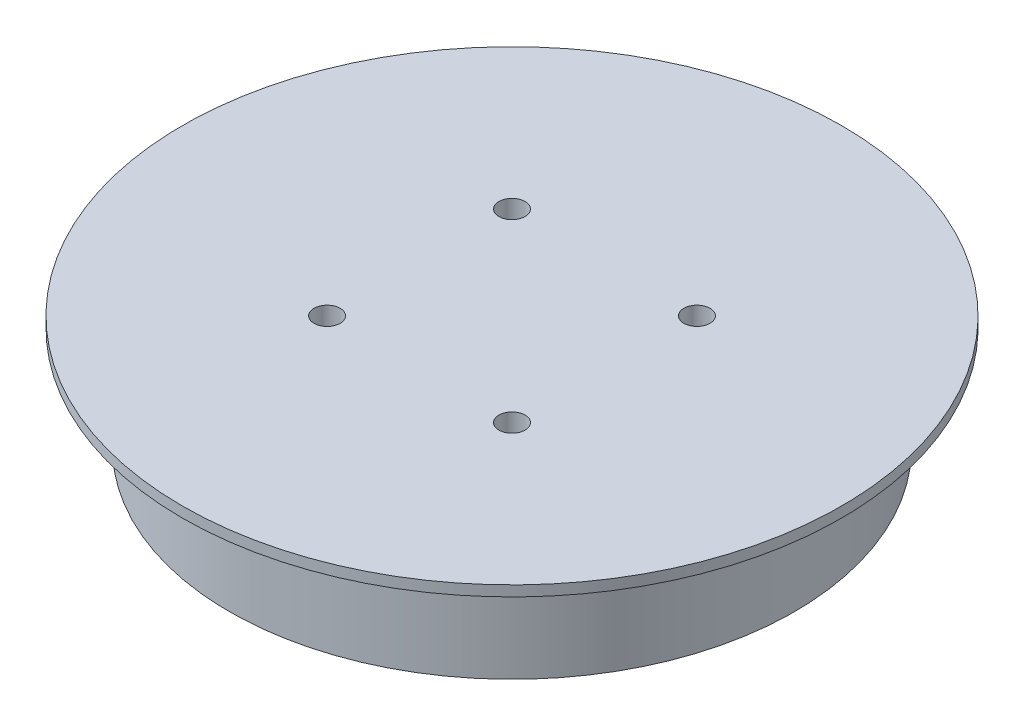
ISO-10303-21;
HEADER;
FILE_DESCRIPTION(('STEP AP214'),'2;1');
FILE_NAME('part.step','',(''),(''),'','','');
FILE_SCHEMA(('AUTOMOTIVE_DESIGN { 1 0 10303 214 1 1 1 1 }'));
ENDSEC;
DATA;
#1=APPLICATION_CONTEXT('core data for automotive mechanical design processes');
#2=APPLICATION_PROTOCOL_DEFINITION('international standard','automotive_design',2000,#1);
#3=PRODUCT_CONTEXT('',#1,'mechanical');
#4=PRODUCT('Part','Part','',(#3));
#5=PRODUCT_RELATED_PRODUCT_CATEGORY('part','',(#4));
#6=PRODUCT_DEFINITION_FORMATION('','',#4);
#7=PRODUCT_DEFINITION_CONTEXT('part definition',#1,'design');
#8=PRODUCT_DEFINITION('design','',#6,#7);
#9=PRODUCT_DEFINITION_SHAPE('','',#8);
#10=(LENGTH_UNIT() NAMED_UNIT(*) SI_UNIT(.MILLI.,.METRE.));
#11=(NAMED_UNIT(*) PLANE_ANGLE_UNIT() SI_UNIT($,.RADIAN.));
#12=(NAMED_UNIT(*) SI_UNIT($,.STERADIAN.) SOLID_ANGLE_UNIT());
#13=UNCERTAINTY_MEASURE_WITH_UNIT(LENGTH_MEASURE(1.E-05),#10,'distance_accuracy_value','');
#14=(GEOMETRIC_REPRESENTATION_CONTEXT(3) GLOBAL_UNCERTAINTY_ASSIGNED_CONTEXT((#13)) GLOBAL_UNIT_ASSIGNED_CONTEXT((#10,
#11,#12)) REPRESENTATION_CONTEXT('',''));
#15=CARTESIAN_POINT('',(0.,0.,0.));
#16=DIRECTION('',(0.,0.,1.));
#17=DIRECTION('',(1.,0.,0.));
#18=AXIS2_PLACEMENT_3D('',#15,#16,#17);
#19=CARTESIAN_POINT('',(0.,11.,0.));
#20=DIRECTION('',(0.,-1.,0.));
#21=DIRECTION('',(0.,0.,-1.));
#22=AXIS2_PLACEMENT_3D('',#19,#20,#21);
#23=CYLINDRICAL_SURFACE('',#22,31.5);
#24=CARTESIAN_POINT('',(0.,11.,0.));
#25=DIRECTION('',(0.,1.,0.));
#26=DIRECTION('',(0.,0.,1.));
#27=AXIS2_PLACEMENT_3D('',#24,#25,#26);
#28=CIRCLE('',#27,31.5);
#29=CARTESIAN_POINT('',(0.,11.,31.5));
#30=VERTEX_POINT('',#29);
#31=EDGE_CURVE('E12',#30,#30,#28,.T.);
#32=ORIENTED_EDGE('',*,*,#31,.F.);
#33=EDGE_LOOP('',(#32));
#34=FACE_BOUND('',#33,.T.);
#35=CARTESIAN_POINT('',(0.,10.,0.));
#36=DIRECTION('',(0.,-1.,0.));
#37=DIRECTION('',(0.,0.,-1.));
#38=AXIS2_PLACEMENT_3D('',#35,#36,#37);
#39=CIRCLE('',#38,31.5);
#40=CARTESIAN_POINT('',(0.,10.,-31.5));
#41=VERTEX_POINT('',#40);
#42=EDGE_CURVE('E37',#41,#41,#39,.T.);
#43=ORIENTED_EDGE('',*,*,#42,.F.);
#44=EDGE_LOOP('',(#43));
#45=FACE_BOUND('',#44,.T.);
#46=ADVANCED_FACE('F34',(#34,#45),#23,.T.);
#47=CARTESIAN_POINT('',(0.,11.,0.));
#48=DIRECTION('',(0.,1.,0.));
#49=DIRECTION('',(0.,0.,1.));
#50=AXIS2_PLACEMENT_3D('',#47,#48,#49);
#51=PLANE('',#50);
#52=CARTESIAN_POINT('',(-8.83883476483184,11.,-8.83883476483184));
#53=DIRECTION('',(0.,1.,0.));
#54=DIRECTION('',(0.,0.,1.));
#55=AXIS2_PLACEMENT_3D('',#52,#53,#54);
#56=CIRCLE('',#55,1.25);
#57=CARTESIAN_POINT('',(-8.83883476483184,11.,-7.58883476483184));
#58=VERTEX_POINT('',#57);
#59=EDGE_CURVE('E66',#58,#58,#56,.T.);
#60=ORIENTED_EDGE('',*,*,#59,.F.);
#61=EDGE_LOOP('',(#60));
#62=FACE_BOUND('',#61,.T.);
#63=CARTESIAN_POINT('',(8.83883476483184,11.,-8.83883476483184));
#64=DIRECTION('',(0.,1.,0.));
#65=DIRECTION('',(0.,0.,1.));
#66=AXIS2_PLACEMENT_3D('',#63,#64,#65);
#67=CIRCLE('',#66,1.25);
#68=CARTESIAN_POINT('',(8.83883476483184,11.,-7.58883476483184));
#69=VERTEX_POINT('',#68);
#70=EDGE_CURVE('E65',#69,#69,#67,.T.);
#71=ORIENTED_EDGE('',*,*,#70,.F.);
#72=EDGE_LOOP('',(#71));
#73=FACE_BOUND('',#72,.T.);
#74=CARTESIAN_POINT('',(8.83883476483184,11.,8.83883476483163));
#75=DIRECTION('',(0.,1.,0.));
#76=DIRECTION('',(0.,0.,1.));
#77=AXIS2_PLACEMENT_3D('',#74,#75,#76);
#78=CIRCLE('',#77,1.25);
#79=CARTESIAN_POINT('',(8.83883476483184,11.,10.0888347648316));
#80=VERTEX_POINT('',#79);
#81=EDGE_CURVE('E77',#80,#80,#78,.T.);
#82=ORIENTED_EDGE('',*,*,#81,.F.);
#83=EDGE_LOOP('',(#82));
#84=FACE_BOUND('',#83,.T.);
#85=CARTESIAN_POINT('',(-8.83883476483184,11.,8.838834764832));
#86=DIRECTION('',(0.,1.,0.));
#87=DIRECTION('',(0.,0.,1.));
#88=AXIS2_PLACEMENT_3D('',#85,#86,#87);
#89=CIRCLE('',#88,1.25);
#90=CARTESIAN_POINT('',(-8.83883476483184,11.,10.088834764832));
#91=VERTEX_POINT('',#90);
#92=EDGE_CURVE('E83',#91,#91,#89,.T.);
#93=ORIENTED_EDGE('',*,*,#92,.F.);
#94=EDGE_LOOP('',(#93));
#95=FACE_BOUND('',#94,.T.);
#96=ORIENTED_EDGE('',*,*,#31,.T.);
#97=EDGE_LOOP('',(#96));
#98=FACE_BOUND('',#97,.T.);
#99=ADVANCED_FACE('F98',(#62,#73,#84,#95,#98),#51,.T.);
#100=CARTESIAN_POINT('',(-8.83883476483184,4.,8.838834764832));
#101=DIRECTION('',(0.,1.,0.));
#102=DIRECTION('',(0.,0.,1.));
#103=AXIS2_PLACEMENT_3D('',#100,#101,#102);
#104=CONICAL_SURFACE('',#103,1.25,1.02974425867665);
#105=CARTESIAN_POINT('',(-8.83883476483185,3.24892422621555,8.838834764832));
#106=VERTEX_POINT('',#105);
#107=VERTEX_LOOP('',#106);
#108=FACE_BOUND('',#107,.T.);
#109=CARTESIAN_POINT('',(-8.83883476483184,4.,8.838834764832));
#110=DIRECTION('',(0.,1.,0.));
#111=DIRECTION('',(0.,0.,1.));
#112=AXIS2_PLACEMENT_3D('',#109,#110,#111);
#113=CIRCLE('',#112,1.25);
#114=CARTESIAN_POINT('',(-8.83883476483184,4.,10.088834764832));
#115=VERTEX_POINT('',#114);
#116=EDGE_CURVE('E42',#115,#115,#113,.T.);
#117=ORIENTED_EDGE('',*,*,#116,.T.);
#118=EDGE_LOOP('',(#117));
#119=FACE_BOUND('',#118,.T.);
#120=ADVANCED_FACE('F89',(#108,#119),#104,.F.);
#121=CARTESIAN_POINT('',(-8.83883476483184,11.,8.838834764832));
#122=DIRECTION('',(0.,1.,0.));
#123=DIRECTION('',(0.,0.,1.));
#124=AXIS2_PLACEMENT_3D('',#121,#122,#123);
#125=CYLINDRICAL_SURFACE('',#124,1.25);
#126=ORIENTED_EDGE('',*,*,#116,.F.);
#127=EDGE_LOOP('',(#126));
#128=FACE_BOUND('',#127,.T.);
#129=ORIENTED_EDGE('',*,*,#92,.T.);
#130=EDGE_LOOP('',(#129));
#131=FACE_BOUND('',#130,.T.);
#132=ADVANCED_FACE('F91',(#128,#131),#125,.F.);
#133=CARTESIAN_POINT('',(8.83883476483184,4.,8.83883476483163));
#134=DIRECTION('',(0.,1.,0.));
#135=DIRECTION('',(0.,0.,1.));
#136=AXIS2_PLACEMENT_3D('',#133,#134,#135);
#137=CONICAL_SURFACE('',#136,1.25,1.02974425867665);
#138=CARTESIAN_POINT('',(8.83883476483184,3.24892422621555,8.83883476483163));
#139=VERTEX_POINT('',#138);
#140=VERTEX_LOOP('',#139);
#141=FACE_BOUND('',#140,.T.);
#142=CARTESIAN_POINT('',(8.83883476483184,4.,8.83883476483163));
#143=DIRECTION('',(0.,1.,0.));
#144=DIRECTION('',(0.,0.,1.));
#145=AXIS2_PLACEMENT_3D('',#142,#143,#144);
#146=CIRCLE('',#145,1.25);
#147=CARTESIAN_POINT('',(8.83883476483184,4.,10.0888347648316));
#148=VERTEX_POINT('',#147);
#149=EDGE_CURVE('E80',#148,#148,#146,.T.);
#150=ORIENTED_EDGE('',*,*,#149,.T.);
#151=EDGE_LOOP('',(#150));
#152=FACE_BOUND('',#151,.T.);
#153=ADVANCED_FACE('F94',(#141,#152),#137,.F.);
#154=CARTESIAN_POINT('',(8.83883476483184,11.,8.83883476483163));
#155=DIRECTION('',(0.,1.,0.));
#156=DIRECTION('',(0.,0.,1.));
#157=AXIS2_PLACEMENT_3D('',#154,#155,#156);
#158=CYLINDRICAL_SURFACE('',#157,1.25);
#159=ORIENTED_EDGE('',*,*,#149,.F.);
#160=EDGE_LOOP('',(#159));
#161=FACE_BOUND('',#160,.T.);
#162=ORIENTED_EDGE('',*,*,#81,.T.);
#163=EDGE_LOOP('',(#162));
#164=FACE_BOUND('',#163,.T.);
#165=ADVANCED_FACE('F140',(#161,#164),#158,.F.);
#166=CARTESIAN_POINT('',(8.83883476483184,4.,-8.83883476483184));
#167=DIRECTION('',(0.,1.,0.));
#168=DIRECTION('',(0.,0.,1.));
#169=AXIS2_PLACEMENT_3D('',#166,#167,#168);
#170=CONICAL_SURFACE('',#169,1.25,1.02974425867665);
#171=CARTESIAN_POINT('',(8.83883476483184,3.24892422621555,-8.83883476483184));
#172=VERTEX_POINT('',#171);
#173=VERTEX_LOOP('',#172);
#174=FACE_BOUND('',#173,.T.);
#175=CARTESIAN_POINT('',(8.83883476483184,4.,-8.83883476483184));
#176=DIRECTION('',(0.,1.,0.));
#177=DIRECTION('',(0.,0.,1.));
#178=AXIS2_PLACEMENT_3D('',#175,#176,#177);
#179=CIRCLE('',#178,1.25);
#180=CARTESIAN_POINT('',(8.83883476483184,4.,-7.58883476483185));
#181=VERTEX_POINT('',#180);
#182=EDGE_CURVE('E69',#181,#181,#179,.T.);
#183=ORIENTED_EDGE('',*,*,#182,.T.);
#184=EDGE_LOOP('',(#183));
#185=FACE_BOUND('',#184,.T.);
#186=ADVANCED_FACE('F136',(#174,#185),#170,.F.);
#187=CARTESIAN_POINT('',(8.83883476483184,11.,-8.83883476483184));
#188=DIRECTION('',(0.,1.,0.));
#189=DIRECTION('',(0.,0.,1.));
#190=AXIS2_PLACEMENT_3D('',#187,#188,#189);
#191=CYLINDRICAL_SURFACE('',#190,1.25);
#192=ORIENTED_EDGE('',*,*,#182,.F.);
#193=EDGE_LOOP('',(#192));
#194=FACE_BOUND('',#193,.T.);
#195=ORIENTED_EDGE('',*,*,#70,.T.);
#196=EDGE_LOOP('',(#195));
#197=FACE_BOUND('',#196,.T.);
#198=ADVANCED_FACE('F59',(#194,#197),#191,.F.);
#199=CARTESIAN_POINT('',(-8.83883476483184,4.,-8.83883476483184));
#200=DIRECTION('',(0.,1.,0.));
#201=DIRECTION('',(0.,0.,1.));
#202=AXIS2_PLACEMENT_3D('',#199,#200,#201);
#203=CONICAL_SURFACE('',#202,1.25,1.02974425867665);
#204=CARTESIAN_POINT('',(-8.83883476483185,3.24892422621555,-8.83883476483184));
#205=VERTEX_POINT('',#204);
#206=VERTEX_LOOP('',#205);
#207=FACE_BOUND('',#206,.T.);
#208=CARTESIAN_POINT('',(-8.83883476483184,4.,-8.83883476483184));
#209=DIRECTION('',(0.,1.,0.));
#210=DIRECTION('',(0.,0.,1.));
#211=AXIS2_PLACEMENT_3D('',#208,#209,#210);
#212=CIRCLE('',#211,1.25);
#213=CARTESIAN_POINT('',(-8.83883476483184,4.,-7.58883476483185));
#214=VERTEX_POINT('',#213);
#215=EDGE_CURVE('E63',#214,#214,#212,.T.);
#216=ORIENTED_EDGE('',*,*,#215,.T.);
#217=EDGE_LOOP('',(#216));
#218=FACE_BOUND('',#217,.T.);
#219=ADVANCED_FACE('F55',(#207,#218),#203,.F.);
#220=CARTESIAN_POINT('',(-8.83883476483184,11.,-8.83883476483184));
#221=DIRECTION('',(0.,1.,0.));
#222=DIRECTION('',(0.,0.,1.));
#223=AXIS2_PLACEMENT_3D('',#220,#221,#222);
#224=CYLINDRICAL_SURFACE('',#223,1.25);
#225=ORIENTED_EDGE('',*,*,#215,.F.);
#226=EDGE_LOOP('',(#225));
#227=FACE_BOUND('',#226,.T.);
#228=ORIENTED_EDGE('',*,*,#59,.T.);
#229=EDGE_LOOP('',(#228));
#230=FACE_BOUND('',#229,.T.);
#231=ADVANCED_FACE('F58',(#227,#230),#224,.F.);
#232=CARTESIAN_POINT('',(0.,10.,0.));
#233=DIRECTION('',(0.,-1.,0.));
#234=DIRECTION('',(0.,0.,-1.));
#235=AXIS2_PLACEMENT_3D('',#232,#233,#234);
#236=PLANE('',#235);
#237=CARTESIAN_POINT('',(0.,10.,0.));
#238=DIRECTION('',(0.,-1.,0.));
#239=DIRECTION('',(0.,0.,-1.));
#240=AXIS2_PLACEMENT_3D('',#237,#238,#239);
#241=CIRCLE('',#240,27.);
#242=CARTESIAN_POINT('',(0.,10.,-27.));
#243=VERTEX_POINT('',#242);
#244=EDGE_CURVE('E110',#243,#243,#241,.T.);
#245=ORIENTED_EDGE('',*,*,#244,.F.);
#246=EDGE_LOOP('',(#245));
#247=FACE_BOUND('',#246,.T.);
#248=ORIENTED_EDGE('',*,*,#42,.T.);
#249=EDGE_LOOP('',(#248));
#250=FACE_BOUND('',#249,.T.);
#251=ADVANCED_FACE('F123',(#247,#250),#236,.T.);
#252=CARTESIAN_POINT('',(0.,10.,0.));
#253=DIRECTION('',(0.,-1.,0.));
#254=DIRECTION('',(0.,0.,-1.));
#255=AXIS2_PLACEMENT_3D('',#252,#253,#254);
#256=CYLINDRICAL_SURFACE('',#255,27.);
#257=ORIENTED_EDGE('',*,*,#244,.T.);
#258=EDGE_LOOP('',(#257));
#259=FACE_BOUND('',#258,.T.);
#260=CARTESIAN_POINT('',(0.,0.,0.));
#261=DIRECTION('',(0.,-1.,0.));
#262=DIRECTION('',(0.,0.,-1.));
#263=AXIS2_PLACEMENT_3D('',#260,#261,#262);
#264=CIRCLE('',#263,27.);
#265=CARTESIAN_POINT('',(0.,0.,-27.));
#266=VERTEX_POINT('',#265);
#267=EDGE_CURVE('E112',#266,#266,#264,.T.);
#268=ORIENTED_EDGE('',*,*,#267,.F.);
#269=EDGE_LOOP('',(#268));
#270=FACE_BOUND('',#269,.T.);
#271=ADVANCED_FACE('F121',(#259,#270),#256,.T.);
#272=CARTESIAN_POINT('',(0.,0.,0.));
#273=DIRECTION('',(0.,1.,0.));
#274=DIRECTION('',(0.,0.,1.));
#275=AXIS2_PLACEMENT_3D('',#272,#273,#274);
#276=PLANE('',#275);
#277=ORIENTED_EDGE('',*,*,#267,.T.);
#278=EDGE_LOOP('',(#277));
#279=FACE_BOUND('',#278,.T.);
#280=ADVANCED_FACE('F119',(#279),#276,.F.);
#281=CLOSED_SHELL('',(#46,#99,#120,#132,#153,#165,#186,#198,#219,#231,#251,#271,#280));
#282=MANIFOLD_SOLID_BREP('B2',#281);
#283=ADVANCED_BREP_SHAPE_REPRESENTATION('',(#18,#282),#14);
#284=SHAPE_DEFINITION_REPRESENTATION(#9,#283);
ENDSEC;
END-ISO-10303-21;
